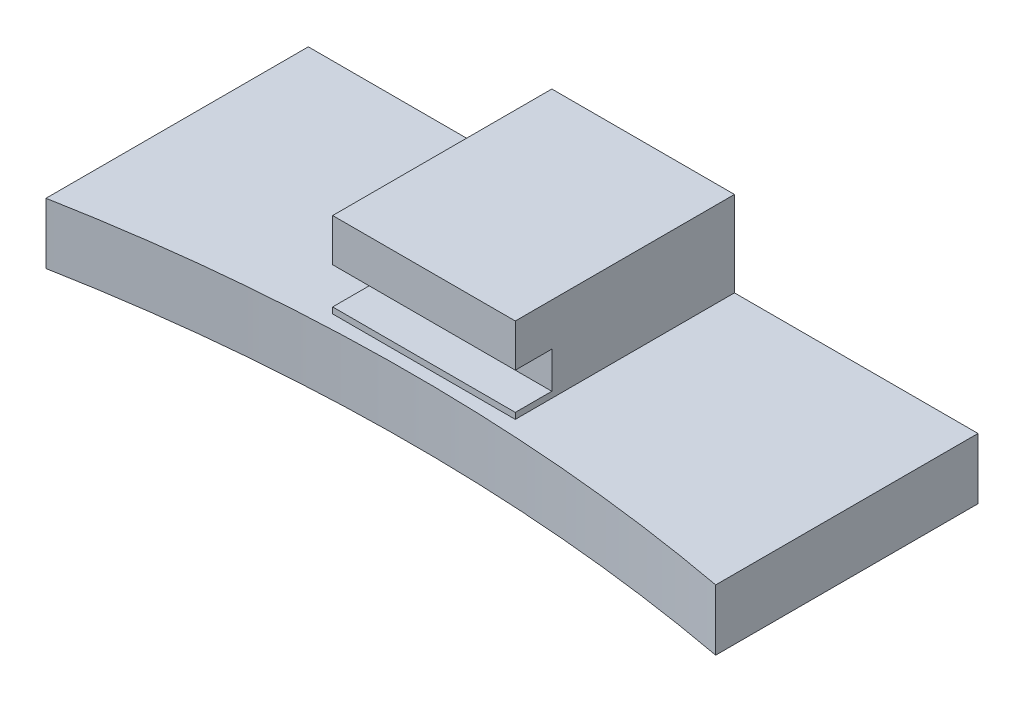
ISO-10303-21;
HEADER;
FILE_DESCRIPTION(('STEP AP214'),'2;1');
FILE_NAME('part.step','',(''),(''),'','','');
FILE_SCHEMA(('AUTOMOTIVE_DESIGN { 1 0 10303 214 1 1 1 1 }'));
ENDSEC;
DATA;
#1=APPLICATION_CONTEXT('core data for automotive mechanical design processes');
#2=APPLICATION_PROTOCOL_DEFINITION('international standard','automotive_design',2000,#1);
#3=PRODUCT_CONTEXT('',#1,'mechanical');
#4=PRODUCT('Part','Part','',(#3));
#5=PRODUCT_RELATED_PRODUCT_CATEGORY('part','',(#4));
#6=PRODUCT_DEFINITION_FORMATION('','',#4);
#7=PRODUCT_DEFINITION_CONTEXT('part definition',#1,'design');
#8=PRODUCT_DEFINITION('design','',#6,#7);
#9=PRODUCT_DEFINITION_SHAPE('','',#8);
#10=(LENGTH_UNIT() NAMED_UNIT(*) SI_UNIT(.MILLI.,.METRE.));
#11=(NAMED_UNIT(*) PLANE_ANGLE_UNIT() SI_UNIT($,.RADIAN.));
#12=(NAMED_UNIT(*) SI_UNIT($,.STERADIAN.) SOLID_ANGLE_UNIT());
#13=UNCERTAINTY_MEASURE_WITH_UNIT(LENGTH_MEASURE(1.E-05),#10,'distance_accuracy_value','');
#14=(GEOMETRIC_REPRESENTATION_CONTEXT(3) GLOBAL_UNCERTAINTY_ASSIGNED_CONTEXT((#13)) GLOBAL_UNIT_ASSIGNED_CONTEXT((#10,
#11,#12)) REPRESENTATION_CONTEXT('',''));
#15=CARTESIAN_POINT('',(0.,0.,0.));
#16=DIRECTION('',(0.,0.,1.));
#17=DIRECTION('',(1.,0.,0.));
#18=AXIS2_PLACEMENT_3D('',#15,#16,#17);
#19=CARTESIAN_POINT('',(55.,5.,-9.99762103058632));
#20=DIRECTION('',(-1.,0.,0.));
#21=DIRECTION('',(0.,0.,1.));
#22=AXIS2_PLACEMENT_3D('',#19,#20,#21);
#23=PLANE('',#22);
#24=DIRECTION('',(0.,0.,-1.));
#25=VECTOR('',#24,1.);
#26=CARTESIAN_POINT('',(55.,0.,-9.99762103058632));
#27=LINE('',#26,#25);
#28=CARTESIAN_POINT('',(55.,0.,-9.99762103058632));
#29=VERTEX_POINT('',#28);
#30=CARTESIAN_POINT('',(55.,0.,-31.54));
#31=VERTEX_POINT('',#30);
#32=EDGE_CURVE('E228',#29,#31,#27,.T.);
#33=ORIENTED_EDGE('',*,*,#32,.T.);
#34=DIRECTION('',(0.,-1.,0.));
#35=VECTOR('',#34,1.);
#36=CARTESIAN_POINT('',(55.,5.,-31.54));
#37=LINE('',#36,#35);
#38=CARTESIAN_POINT('',(55.,5.,-31.54));
#39=VERTEX_POINT('',#38);
#40=EDGE_CURVE('E11',#39,#31,#37,.T.);
#41=ORIENTED_EDGE('',*,*,#40,.F.);
#42=DIRECTION('',(0.,0.,-1.));
#43=VECTOR('',#42,1.);
#44=CARTESIAN_POINT('',(55.,5.,-9.99762103058632));
#45=LINE('',#44,#43);
#46=CARTESIAN_POINT('',(55.,5.,-9.99762103058632));
#47=VERTEX_POINT('',#46);
#48=EDGE_CURVE('E229',#47,#39,#45,.T.);
#49=ORIENTED_EDGE('',*,*,#48,.F.);
#50=DIRECTION('',(0.,-1.,0.));
#51=VECTOR('',#50,1.);
#52=CARTESIAN_POINT('',(55.,5.,-9.99762103058632));
#53=LINE('',#52,#51);
#54=EDGE_CURVE('E249',#47,#29,#53,.T.);
#55=ORIENTED_EDGE('',*,*,#54,.T.);
#56=EDGE_LOOP('',(#33,#41,#49,#55));
#57=FACE_BOUND('',#56,.T.);
#58=ADVANCED_FACE('F39',(#57),#23,.F.);
#59=CARTESIAN_POINT('',(0.,5.,-31.54));
#60=DIRECTION('',(0.,0.,1.));
#61=DIRECTION('',(1.,0.,0.));
#62=AXIS2_PLACEMENT_3D('',#59,#60,#61);
#63=PLANE('',#62);
#64=CARTESIAN_POINT('',(27.5,6.5,-31.54));
#65=DIRECTION('',(0.,0.,-1.));
#66=DIRECTION('',(-1.,0.,0.));
#67=AXIS2_PLACEMENT_3D('',#64,#65,#66);
#68=CIRCLE('',#67,4.5);
#69=CARTESIAN_POINT('',(23.,6.5,-31.54));
#70=VERTEX_POINT('',#69);
#71=EDGE_CURVE('E141',#70,#70,#68,.T.);
#72=ORIENTED_EDGE('',*,*,#71,.F.);
#73=EDGE_LOOP('',(#72));
#74=FACE_BOUND('',#73,.T.);
#75=DIRECTION('',(-1.,0.,0.));
#76=VECTOR('',#75,1.);
#77=CARTESIAN_POINT('',(0.,0.,-31.54));
#78=LINE('',#77,#76);
#79=CARTESIAN_POINT('',(0.,0.,-31.54));
#80=VERTEX_POINT('',#79);
#81=EDGE_CURVE('E256',#31,#80,#78,.T.);
#82=ORIENTED_EDGE('',*,*,#81,.T.);
#83=DIRECTION('',(0.,-1.,0.));
#84=VECTOR('',#83,1.);
#85=CARTESIAN_POINT('',(0.,5.,-31.54));
#86=LINE('',#85,#84);
#87=CARTESIAN_POINT('',(0.,5.,-31.54));
#88=VERTEX_POINT('',#87);
#89=EDGE_CURVE('E48',#88,#80,#86,.T.);
#90=ORIENTED_EDGE('',*,*,#89,.F.);
#91=DIRECTION('',(-1.,0.,0.));
#92=VECTOR('',#91,1.);
#93=CARTESIAN_POINT('',(0.,5.,-31.54));
#94=LINE('',#93,#92);
#95=CARTESIAN_POINT('',(20.,5.,-31.54));
#96=VERTEX_POINT('',#95);
#97=EDGE_CURVE('E232',#96,#88,#94,.T.);
#98=ORIENTED_EDGE('',*,*,#97,.F.);
#99=DIRECTION('',(0.,-1.,0.));
#100=VECTOR('',#99,1.);
#101=CARTESIAN_POINT('',(20.,5.5,-31.54));
#102=LINE('',#101,#100);
#103=CARTESIAN_POINT('',(20.,12.,-31.54));
#104=VERTEX_POINT('',#103);
#105=EDGE_CURVE('E215',#104,#96,#102,.T.);
#106=ORIENTED_EDGE('',*,*,#105,.F.);
#107=DIRECTION('',(-1.,0.,0.));
#108=VECTOR('',#107,1.);
#109=CARTESIAN_POINT('',(20.,12.,-31.54));
#110=LINE('',#109,#108);
#111=CARTESIAN_POINT('',(35.,12.,-31.54));
#112=VERTEX_POINT('',#111);
#113=EDGE_CURVE('E164',#112,#104,#110,.T.);
#114=ORIENTED_EDGE('',*,*,#113,.F.);
#115=DIRECTION('',(0.,-1.,0.));
#116=VECTOR('',#115,1.);
#117=CARTESIAN_POINT('',(35.,5.5,-31.54));
#118=LINE('',#117,#116);
#119=CARTESIAN_POINT('',(35.,5.,-31.54));
#120=VERTEX_POINT('',#119);
#121=EDGE_CURVE('E211',#112,#120,#118,.T.);
#122=ORIENTED_EDGE('',*,*,#121,.T.);
#123=EDGE_CURVE('E242',#39,#120,#94,.T.);
#124=ORIENTED_EDGE('',*,*,#123,.F.);
#125=ORIENTED_EDGE('',*,*,#40,.T.);
#126=EDGE_LOOP('',(#82,#90,#98,#106,#114,#122,#124,#125));
#127=FACE_BOUND('',#126,.T.);
#128=ADVANCED_FACE('F281',(#74,#127),#63,.F.);
#129=CARTESIAN_POINT('',(0.,5.,-9.99762103058632));
#130=DIRECTION('',(1.,0.,0.));
#131=DIRECTION('',(0.,0.,-1.));
#132=AXIS2_PLACEMENT_3D('',#129,#130,#131);
#133=PLANE('',#132);
#134=DIRECTION('',(0.,0.,1.));
#135=VECTOR('',#134,1.);
#136=CARTESIAN_POINT('',(0.,0.,-9.99762103058632));
#137=LINE('',#136,#135);
#138=CARTESIAN_POINT('',(0.,0.,-9.99762103058632));
#139=VERTEX_POINT('',#138);
#140=EDGE_CURVE('E254',#80,#139,#137,.T.);
#141=ORIENTED_EDGE('',*,*,#140,.T.);
#142=DIRECTION('',(0.,-1.,0.));
#143=VECTOR('',#142,1.);
#144=CARTESIAN_POINT('',(0.,5.,-9.99762103058632));
#145=LINE('',#144,#143);
#146=CARTESIAN_POINT('',(0.,5.,-9.99762103058632));
#147=VERTEX_POINT('',#146);
#148=EDGE_CURVE('E246',#147,#139,#145,.T.);
#149=ORIENTED_EDGE('',*,*,#148,.F.);
#150=DIRECTION('',(0.,0.,1.));
#151=VECTOR('',#150,1.);
#152=CARTESIAN_POINT('',(0.,5.,-9.99762103058632));
#153=LINE('',#152,#151);
#154=EDGE_CURVE('E236',#88,#147,#153,.T.);
#155=ORIENTED_EDGE('',*,*,#154,.F.);
#156=ORIENTED_EDGE('',*,*,#89,.T.);
#157=EDGE_LOOP('',(#141,#149,#155,#156));
#158=FACE_BOUND('',#157,.T.);
#159=ADVANCED_FACE('F267',(#158),#133,.F.);
#160=CARTESIAN_POINT('',(27.5,5.,137.46));
#161=DIRECTION('',(0.,-1.,0.));
#162=DIRECTION('',(0.,0.,-1.));
#163=AXIS2_PLACEMENT_3D('',#160,#161,#162);
#164=CYLINDRICAL_SURFACE('',#163,150.);
#165=CARTESIAN_POINT('',(27.5,0.,137.46));
#166=DIRECTION('',(0.,-1.,0.));
#167=DIRECTION('',(0.,0.,1.));
#168=AXIS2_PLACEMENT_3D('',#165,#166,#167);
#169=CIRCLE('',#168,150.);
#170=EDGE_CURVE('E233',#139,#29,#169,.T.);
#171=ORIENTED_EDGE('',*,*,#170,.T.);
#172=ORIENTED_EDGE('',*,*,#54,.F.);
#173=CARTESIAN_POINT('',(27.5,5.,137.46));
#174=DIRECTION('',(0.,-1.,0.));
#175=DIRECTION('',(0.,0.,1.));
#176=AXIS2_PLACEMENT_3D('',#173,#174,#175);
#177=CIRCLE('',#176,150.);
#178=EDGE_CURVE('E252',#147,#47,#177,.T.);
#179=ORIENTED_EDGE('',*,*,#178,.F.);
#180=ORIENTED_EDGE('',*,*,#148,.T.);
#181=EDGE_LOOP('',(#171,#172,#179,#180));
#182=FACE_BOUND('',#181,.T.);
#183=ADVANCED_FACE('F271',(#182),#164,.F.);
#184=CARTESIAN_POINT('',(27.5,5.,137.46));
#185=DIRECTION('',(0.,1.,0.));
#186=DIRECTION('',(0.,0.,1.));
#187=AXIS2_PLACEMENT_3D('',#184,#185,#186);
#188=PLANE('',#187);
#189=DIRECTION('',(0.,0.,1.));
#190=VECTOR('',#189,1.);
#191=CARTESIAN_POINT('',(20.,5.,-31.54));
#192=LINE('',#191,#190);
#193=CARTESIAN_POINT('',(20.,5.,-13.54));
#194=VERTEX_POINT('',#193);
#195=EDGE_CURVE('E492',#96,#194,#192,.T.);
#196=ORIENTED_EDGE('',*,*,#195,.F.);
#197=ORIENTED_EDGE('',*,*,#97,.T.);
#198=ORIENTED_EDGE('',*,*,#154,.T.);
#199=ORIENTED_EDGE('',*,*,#178,.T.);
#200=ORIENTED_EDGE('',*,*,#48,.T.);
#201=ORIENTED_EDGE('',*,*,#123,.T.);
#202=DIRECTION('',(0.,0.,-1.));
#203=VECTOR('',#202,1.);
#204=CARTESIAN_POINT('',(35.,5.,-31.54));
#205=LINE('',#204,#203);
#206=CARTESIAN_POINT('',(35.,5.,-13.54));
#207=VERTEX_POINT('',#206);
#208=EDGE_CURVE('E208',#207,#120,#205,.T.);
#209=ORIENTED_EDGE('',*,*,#208,.F.);
#210=DIRECTION('',(1.,0.,0.));
#211=VECTOR('',#210,1.);
#212=CARTESIAN_POINT('',(20.,5.,-13.54));
#213=LINE('',#212,#211);
#214=EDGE_CURVE('E64',#194,#207,#213,.T.);
#215=ORIENTED_EDGE('',*,*,#214,.F.);
#216=EDGE_LOOP('',(#196,#197,#198,#199,#200,#201,#209,#215));
#217=FACE_BOUND('',#216,.T.);
#218=ADVANCED_FACE('F263',(#217),#188,.T.);
#219=CARTESIAN_POINT('',(27.5,0.,137.46));
#220=DIRECTION('',(0.,1.,0.));
#221=DIRECTION('',(0.,0.,1.));
#222=AXIS2_PLACEMENT_3D('',#219,#220,#221);
#223=PLANE('',#222);
#224=ORIENTED_EDGE('',*,*,#32,.F.);
#225=ORIENTED_EDGE('',*,*,#170,.F.);
#226=ORIENTED_EDGE('',*,*,#140,.F.);
#227=ORIENTED_EDGE('',*,*,#81,.F.);
#228=EDGE_LOOP('',(#224,#225,#226,#227));
#229=FACE_BOUND('',#228,.T.);
#230=ADVANCED_FACE('F320',(#229),#223,.F.);
#231=CARTESIAN_POINT('',(20.,5.5,-31.54));
#232=DIRECTION('',(1.,0.,0.));
#233=DIRECTION('',(0.,0.,-1.));
#234=AXIS2_PLACEMENT_3D('',#231,#232,#233);
#235=PLANE('',#234);
#236=ORIENTED_EDGE('',*,*,#195,.T.);
#237=DIRECTION('',(0.,-1.,0.));
#238=VECTOR('',#237,1.);
#239=CARTESIAN_POINT('',(20.,5.5,-13.54));
#240=LINE('',#239,#238);
#241=CARTESIAN_POINT('',(20.,5.5,-13.54));
#242=VERTEX_POINT('',#241);
#243=EDGE_CURVE('E226',#242,#194,#240,.T.);
#244=ORIENTED_EDGE('',*,*,#243,.F.);
#245=DIRECTION('',(0.,0.,1.));
#246=VECTOR('',#245,1.);
#247=CARTESIAN_POINT('',(20.,5.5,-31.54));
#248=LINE('',#247,#246);
#249=CARTESIAN_POINT('',(20.,5.5,-16.54));
#250=VERTEX_POINT('',#249);
#251=EDGE_CURVE('E206',#250,#242,#248,.T.);
#252=ORIENTED_EDGE('',*,*,#251,.F.);
#253=DIRECTION('',(0.,-1.,0.));
#254=VECTOR('',#253,1.);
#255=CARTESIAN_POINT('',(20.,8.5,-16.54));
#256=LINE('',#255,#254);
#257=CARTESIAN_POINT('',(20.,8.5,-16.54));
#258=VERTEX_POINT('',#257);
#259=EDGE_CURVE('E292',#258,#250,#256,.T.);
#260=ORIENTED_EDGE('',*,*,#259,.F.);
#261=DIRECTION('',(0.,0.,1.));
#262=VECTOR('',#261,1.);
#263=CARTESIAN_POINT('',(20.,8.5,-31.54));
#264=LINE('',#263,#262);
#265=CARTESIAN_POINT('',(20.,8.5,-13.54));
#266=VERTEX_POINT('',#265);
#267=EDGE_CURVE('E153',#258,#266,#264,.T.);
#268=ORIENTED_EDGE('',*,*,#267,.T.);
#269=DIRECTION('',(0.,-1.,0.));
#270=VECTOR('',#269,1.);
#271=CARTESIAN_POINT('',(20.,12.,-13.54));
#272=LINE('',#271,#270);
#273=CARTESIAN_POINT('',(20.,12.,-13.54));
#274=VERTEX_POINT('',#273);
#275=EDGE_CURVE('E175',#274,#266,#272,.T.);
#276=ORIENTED_EDGE('',*,*,#275,.F.);
#277=DIRECTION('',(0.,0.,1.));
#278=VECTOR('',#277,1.);
#279=CARTESIAN_POINT('',(20.,12.,-31.54));
#280=LINE('',#279,#278);
#281=EDGE_CURVE('E155',#104,#274,#280,.T.);
#282=ORIENTED_EDGE('',*,*,#281,.F.);
#283=ORIENTED_EDGE('',*,*,#105,.T.);
#284=EDGE_LOOP('',(#236,#244,#252,#260,#268,#276,#282,#283));
#285=FACE_BOUND('',#284,.T.);
#286=ADVANCED_FACE('F288',(#285),#235,.F.);
#287=CARTESIAN_POINT('',(20.,5.5,-13.54));
#288=DIRECTION('',(0.,0.,-1.));
#289=DIRECTION('',(-1.,0.,0.));
#290=AXIS2_PLACEMENT_3D('',#287,#288,#289);
#291=PLANE('',#290);
#292=ORIENTED_EDGE('',*,*,#214,.T.);
#293=DIRECTION('',(0.,-1.,0.));
#294=VECTOR('',#293,1.);
#295=CARTESIAN_POINT('',(35.,5.5,-13.54));
#296=LINE('',#295,#294);
#297=CARTESIAN_POINT('',(35.,5.5,-13.54));
#298=VERTEX_POINT('',#297);
#299=EDGE_CURVE('E214',#298,#207,#296,.T.);
#300=ORIENTED_EDGE('',*,*,#299,.F.);
#301=DIRECTION('',(1.,0.,0.));
#302=VECTOR('',#301,1.);
#303=CARTESIAN_POINT('',(20.,5.5,-13.54));
#304=LINE('',#303,#302);
#305=EDGE_CURVE('E205',#242,#298,#304,.T.);
#306=ORIENTED_EDGE('',*,*,#305,.F.);
#307=ORIENTED_EDGE('',*,*,#243,.T.);
#308=EDGE_LOOP('',(#292,#300,#306,#307));
#309=FACE_BOUND('',#308,.T.);
#310=ADVANCED_FACE('F328',(#309),#291,.F.);
#311=CARTESIAN_POINT('',(35.,5.5,-31.54));
#312=DIRECTION('',(-1.,0.,0.));
#313=DIRECTION('',(0.,0.,1.));
#314=AXIS2_PLACEMENT_3D('',#311,#312,#313);
#315=PLANE('',#314);
#316=ORIENTED_EDGE('',*,*,#208,.T.);
#317=ORIENTED_EDGE('',*,*,#121,.F.);
#318=DIRECTION('',(0.,0.,-1.));
#319=VECTOR('',#318,1.);
#320=CARTESIAN_POINT('',(35.,12.,-31.54));
#321=LINE('',#320,#319);
#322=CARTESIAN_POINT('',(35.,12.,-13.54));
#323=VERTEX_POINT('',#322);
#324=EDGE_CURVE('E161',#323,#112,#321,.T.);
#325=ORIENTED_EDGE('',*,*,#324,.F.);
#326=DIRECTION('',(0.,-1.,0.));
#327=VECTOR('',#326,1.);
#328=CARTESIAN_POINT('',(35.,12.,-13.54));
#329=LINE('',#328,#327);
#330=CARTESIAN_POINT('',(35.,8.5,-13.54));
#331=VERTEX_POINT('',#330);
#332=EDGE_CURVE('E167',#323,#331,#329,.T.);
#333=ORIENTED_EDGE('',*,*,#332,.T.);
#334=DIRECTION('',(0.,0.,-1.));
#335=VECTOR('',#334,1.);
#336=CARTESIAN_POINT('',(35.,8.5,-31.54));
#337=LINE('',#336,#335);
#338=CARTESIAN_POINT('',(35.,8.5,-16.54));
#339=VERTEX_POINT('',#338);
#340=EDGE_CURVE('E159',#331,#339,#337,.T.);
#341=ORIENTED_EDGE('',*,*,#340,.T.);
#342=DIRECTION('',(0.,-1.,0.));
#343=VECTOR('',#342,1.);
#344=CARTESIAN_POINT('',(35.,8.5,-16.54));
#345=LINE('',#344,#343);
#346=CARTESIAN_POINT('',(35.,5.5,-16.54));
#347=VERTEX_POINT('',#346);
#348=EDGE_CURVE('E194',#339,#347,#345,.T.);
#349=ORIENTED_EDGE('',*,*,#348,.T.);
#350=DIRECTION('',(0.,0.,-1.));
#351=VECTOR('',#350,1.);
#352=CARTESIAN_POINT('',(35.,5.5,-31.54));
#353=LINE('',#352,#351);
#354=EDGE_CURVE('E197',#298,#347,#353,.T.);
#355=ORIENTED_EDGE('',*,*,#354,.F.);
#356=ORIENTED_EDGE('',*,*,#299,.T.);
#357=EDGE_LOOP('',(#316,#317,#325,#333,#341,#349,#355,#356));
#358=FACE_BOUND('',#357,.T.);
#359=ADVANCED_FACE('F277',(#358),#315,.F.);
#360=CARTESIAN_POINT('',(0.,5.5,0.));
#361=DIRECTION('',(0.,1.,0.));
#362=DIRECTION('',(0.,0.,1.));
#363=AXIS2_PLACEMENT_3D('',#360,#361,#362);
#364=PLANE('',#363);
#365=DIRECTION('',(1.,0.,0.));
#366=VECTOR('',#365,1.);
#367=CARTESIAN_POINT('',(20.,5.5,-16.54));
#368=LINE('',#367,#366);
#369=EDGE_CURVE('E56',#250,#347,#368,.T.);
#370=ORIENTED_EDGE('',*,*,#369,.F.);
#371=ORIENTED_EDGE('',*,*,#251,.T.);
#372=ORIENTED_EDGE('',*,*,#305,.T.);
#373=ORIENTED_EDGE('',*,*,#354,.T.);
#374=EDGE_LOOP('',(#370,#371,#372,#373));
#375=FACE_BOUND('',#374,.T.);
#376=ADVANCED_FACE('F334',(#375),#364,.T.);
#377=CARTESIAN_POINT('',(20.,8.5,-16.54));
#378=DIRECTION('',(0.,0.,-1.));
#379=DIRECTION('',(-1.,0.,0.));
#380=AXIS2_PLACEMENT_3D('',#377,#378,#379);
#381=PLANE('',#380);
#382=ORIENTED_EDGE('',*,*,#369,.T.);
#383=ORIENTED_EDGE('',*,*,#348,.F.);
#384=DIRECTION('',(1.,0.,0.));
#385=VECTOR('',#384,1.);
#386=CARTESIAN_POINT('',(20.,8.5,-16.54));
#387=LINE('',#386,#385);
#388=EDGE_CURVE('E42',#258,#339,#387,.T.);
#389=ORIENTED_EDGE('',*,*,#388,.F.);
#390=ORIENTED_EDGE('',*,*,#259,.T.);
#391=EDGE_LOOP('',(#382,#383,#389,#390));
#392=FACE_BOUND('',#391,.T.);
#393=ADVANCED_FACE('F304',(#392),#381,.F.);
#394=CARTESIAN_POINT('',(0.,8.5,0.));
#395=DIRECTION('',(0.,1.,0.));
#396=DIRECTION('',(0.,0.,1.));
#397=AXIS2_PLACEMENT_3D('',#394,#395,#396);
#398=PLANE('',#397);
#399=ORIENTED_EDGE('',*,*,#267,.F.);
#400=ORIENTED_EDGE('',*,*,#388,.T.);
#401=ORIENTED_EDGE('',*,*,#340,.F.);
#402=DIRECTION('',(1.,0.,0.));
#403=VECTOR('',#402,1.);
#404=CARTESIAN_POINT('',(20.,8.5,-13.54));
#405=LINE('',#404,#403);
#406=EDGE_CURVE('E170',#266,#331,#405,.T.);
#407=ORIENTED_EDGE('',*,*,#406,.F.);
#408=EDGE_LOOP('',(#399,#400,#401,#407));
#409=FACE_BOUND('',#408,.T.);
#410=ADVANCED_FACE('F294',(#409),#398,.F.);
#411=CARTESIAN_POINT('',(20.,12.,-13.54));
#412=DIRECTION('',(0.,0.,-1.));
#413=DIRECTION('',(-1.,0.,0.));
#414=AXIS2_PLACEMENT_3D('',#411,#412,#413);
#415=PLANE('',#414);
#416=ORIENTED_EDGE('',*,*,#406,.T.);
#417=ORIENTED_EDGE('',*,*,#332,.F.);
#418=DIRECTION('',(1.,0.,0.));
#419=VECTOR('',#418,1.);
#420=CARTESIAN_POINT('',(20.,12.,-13.54));
#421=LINE('',#420,#419);
#422=EDGE_CURVE('E158',#274,#323,#421,.T.);
#423=ORIENTED_EDGE('',*,*,#422,.F.);
#424=ORIENTED_EDGE('',*,*,#275,.T.);
#425=EDGE_LOOP('',(#416,#417,#423,#424));
#426=FACE_BOUND('',#425,.T.);
#427=ADVANCED_FACE('F295',(#426),#415,.F.);
#428=CARTESIAN_POINT('',(0.,12.,0.));
#429=DIRECTION('',(0.,1.,0.));
#430=DIRECTION('',(0.,0.,1.));
#431=AXIS2_PLACEMENT_3D('',#428,#429,#430);
#432=PLANE('',#431);
#433=ORIENTED_EDGE('',*,*,#281,.T.);
#434=ORIENTED_EDGE('',*,*,#422,.T.);
#435=ORIENTED_EDGE('',*,*,#324,.T.);
#436=ORIENTED_EDGE('',*,*,#113,.T.);
#437=EDGE_LOOP('',(#433,#434,#435,#436));
#438=FACE_BOUND('',#437,.T.);
#439=ADVANCED_FACE('F285',(#438),#432,.T.);
#440=CARTESIAN_POINT('',(27.5,6.5,-27.54));
#441=DIRECTION('',(0.,0.,-1.));
#442=DIRECTION('',(-1.,0.,0.));
#443=AXIS2_PLACEMENT_3D('',#440,#441,#442);
#444=CYLINDRICAL_SURFACE('',#443,4.5);
#445=CARTESIAN_POINT('',(27.5,6.5,-27.54));
#446=DIRECTION('',(0.,0.,-1.));
#447=DIRECTION('',(-1.,0.,0.));
#448=AXIS2_PLACEMENT_3D('',#445,#446,#447);
#449=CIRCLE('',#448,4.5);
#450=CARTESIAN_POINT('',(23.,6.5,-27.54));
#451=VERTEX_POINT('',#450);
#452=EDGE_CURVE('E145',#451,#451,#449,.T.);
#453=ORIENTED_EDGE('',*,*,#452,.F.);
#454=EDGE_LOOP('',(#453));
#455=FACE_BOUND('',#454,.T.);
#456=ORIENTED_EDGE('',*,*,#71,.T.);
#457=EDGE_LOOP('',(#456));
#458=FACE_BOUND('',#457,.T.);
#459=ADVANCED_FACE('F302',(#455,#458),#444,.F.);
#460=CARTESIAN_POINT('',(27.5,6.5,-27.54));
#461=DIRECTION('',(0.,0.,-1.));
#462=DIRECTION('',(-1.,0.,0.));
#463=AXIS2_PLACEMENT_3D('',#460,#461,#462);
#464=PLANE('',#463);
#465=CARTESIAN_POINT('',(27.5,6.5,-27.54));
#466=DIRECTION('',(0.,0.,-1.));
#467=DIRECTION('',(-1.,0.,0.));
#468=AXIS2_PLACEMENT_3D('',#465,#466,#467);
#469=CIRCLE('',#468,4.025);
#470=CARTESIAN_POINT('',(23.475,6.5,-27.54));
#471=VERTEX_POINT('',#470);
#472=EDGE_CURVE('E148',#471,#471,#469,.T.);
#473=ORIENTED_EDGE('',*,*,#472,.F.);
#474=EDGE_LOOP('',(#473));
#475=FACE_BOUND('',#474,.T.);
#476=ORIENTED_EDGE('',*,*,#452,.T.);
#477=EDGE_LOOP('',(#476));
#478=FACE_BOUND('',#477,.T.);
#479=ADVANCED_FACE('F135',(#475,#478),#464,.T.);
#480=CARTESIAN_POINT('',(27.5,6.5,-19.54));
#481=DIRECTION('',(0.,0.,-1.));
#482=DIRECTION('',(-1.,0.,0.));
#483=AXIS2_PLACEMENT_3D('',#480,#481,#482);
#484=CONICAL_SURFACE('',#483,3.5,1.02974425867665);
#485=CARTESIAN_POINT('',(27.5,6.5,-17.4369878334035));
#486=VERTEX_POINT('',#485);
#487=VERTEX_LOOP('',#486);
#488=FACE_BOUND('',#487,.T.);
#489=CARTESIAN_POINT('',(27.5,6.5,-19.54));
#490=DIRECTION('',(0.,0.,-1.));
#491=DIRECTION('',(-1.,0.,0.));
#492=AXIS2_PLACEMENT_3D('',#489,#490,#491);
#493=CIRCLE('',#492,3.5);
#494=CARTESIAN_POINT('',(24.,6.5,-19.54));
#495=VERTEX_POINT('',#494);
#496=EDGE_CURVE('E139',#495,#495,#493,.T.);
#497=ORIENTED_EDGE('',*,*,#496,.T.);
#498=EDGE_LOOP('',(#497));
#499=FACE_BOUND('',#498,.T.);
#500=ADVANCED_FACE('F131',(#488,#499),#484,.F.);
#501=CARTESIAN_POINT('',(27.5,6.5,-27.54));
#502=DIRECTION('',(0.,0.,-1.));
#503=DIRECTION('',(-1.,0.,0.));
#504=AXIS2_PLACEMENT_3D('',#501,#502,#503);
#505=CYLINDRICAL_SURFACE('',#504,3.5);
#506=ORIENTED_EDGE('',*,*,#496,.F.);
#507=EDGE_LOOP('',(#506));
#508=FACE_BOUND('',#507,.T.);
#509=CARTESIAN_POINT('',(27.5,6.5,-27.015));
#510=DIRECTION('',(0.,0.,-1.));
#511=DIRECTION('',(-1.,0.,0.));
#512=AXIS2_PLACEMENT_3D('',#509,#510,#511);
#513=CIRCLE('',#512,3.5);
#514=CARTESIAN_POINT('',(24.,6.5,-27.015));
#515=VERTEX_POINT('',#514);
#516=EDGE_CURVE('E142',#515,#515,#513,.T.);
#517=ORIENTED_EDGE('',*,*,#516,.T.);
#518=EDGE_LOOP('',(#517));
#519=FACE_BOUND('',#518,.T.);
#520=ADVANCED_FACE('F134',(#508,#519),#505,.F.);
#521=CARTESIAN_POINT('',(27.5,6.5,-27.54));
#522=DIRECTION('',(0.,0.,-1.));
#523=DIRECTION('',(-1.,0.,0.));
#524=AXIS2_PLACEMENT_3D('',#521,#522,#523);
#525=CONICAL_SURFACE('',#524,4.025,0.785398163397448);
#526=ORIENTED_EDGE('',*,*,#516,.F.);
#527=EDGE_LOOP('',(#526));
#528=FACE_BOUND('',#527,.T.);
#529=ORIENTED_EDGE('',*,*,#472,.T.);
#530=EDGE_LOOP('',(#529));
#531=FACE_BOUND('',#530,.T.);
#532=ADVANCED_FACE('F397',(#528,#531),#525,.F.);
#533=CLOSED_SHELL('',(#58,#128,#159,#183,#218,#230,#286,#310,#359,#376,#393,#410,#427,#439,#459,
#479,#500,#520,#532));
#534=MANIFOLD_SOLID_BREP('B2',#533);
#535=ADVANCED_BREP_SHAPE_REPRESENTATION('',(#18,#534),#14);
#536=SHAPE_DEFINITION_REPRESENTATION(#9,#535);
ENDSEC;
END-ISO-10303-21;
